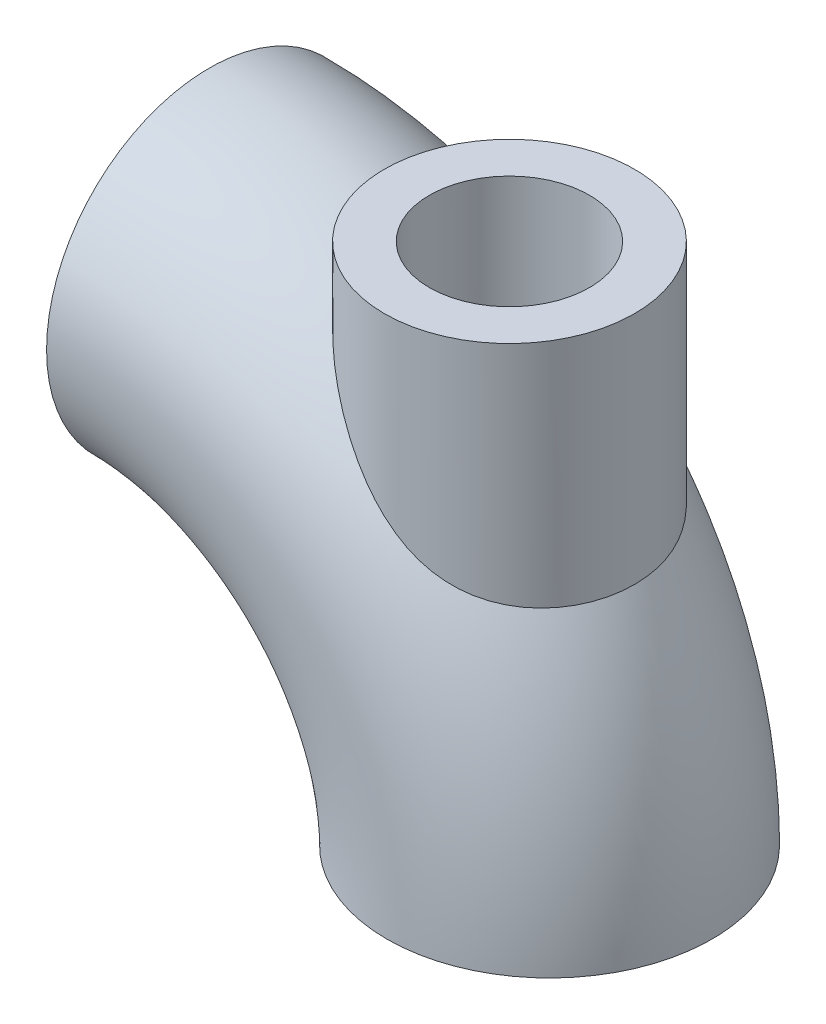
ISO-10303-21;
HEADER;
FILE_DESCRIPTION(('STEP AP214'),'2;1');
FILE_NAME('part.step','',(''),(''),'','','');
FILE_SCHEMA(('AUTOMOTIVE_DESIGN { 1 0 10303 214 1 1 1 1 }'));
ENDSEC;
DATA;
#1=APPLICATION_CONTEXT('core data for automotive mechanical design processes');
#2=APPLICATION_PROTOCOL_DEFINITION('international standard','automotive_design',2000,#1);
#3=PRODUCT_CONTEXT('',#1,'mechanical');
#4=PRODUCT('Part','Part','',(#3));
#5=PRODUCT_RELATED_PRODUCT_CATEGORY('part','',(#4));
#6=PRODUCT_DEFINITION_FORMATION('','',#4);
#7=PRODUCT_DEFINITION_CONTEXT('part definition',#1,'design');
#8=PRODUCT_DEFINITION('design','',#6,#7);
#9=PRODUCT_DEFINITION_SHAPE('','',#8);
#10=(LENGTH_UNIT() NAMED_UNIT(*) SI_UNIT(.MILLI.,.METRE.));
#11=(NAMED_UNIT(*) PLANE_ANGLE_UNIT() SI_UNIT($,.RADIAN.));
#12=(NAMED_UNIT(*) SI_UNIT($,.STERADIAN.) SOLID_ANGLE_UNIT());
#13=UNCERTAINTY_MEASURE_WITH_UNIT(LENGTH_MEASURE(1.E-05),#10,'distance_accuracy_value','');
#14=(GEOMETRIC_REPRESENTATION_CONTEXT(3) GLOBAL_UNCERTAINTY_ASSIGNED_CONTEXT((#13)) GLOBAL_UNIT_ASSIGNED_CONTEXT((#10,
#11,#12)) REPRESENTATION_CONTEXT('',''));
#15=CARTESIAN_POINT('',(0.,0.,0.));
#16=DIRECTION('',(0.,0.,1.));
#17=DIRECTION('',(1.,0.,0.));
#18=AXIS2_PLACEMENT_3D('',#15,#16,#17);
#19=CARTESIAN_POINT('',(-68.,0.,0.));
#20=DIRECTION('',(0.,0.,-1.));
#21=DIRECTION('',(-1.,0.,0.));
#22=AXIS2_PLACEMENT_3D('',#19,#20,#21);
#23=TOROIDAL_SURFACE('',#22,68.,20.);
#24=CARTESIAN_POINT('',(0.251674053511512,46.458689869364,-13.7080222977133));
#25=CARTESIAN_POINT('',(0.579883240702387,46.3070119127707,-13.5104488063518));
#26=CARTESIAN_POINT('',(0.905013391545234,46.1670687579967,-13.2986413226634));
#27=CARTESIAN_POINT('',(1.54464572796947,45.9092450303312,-12.8472967635571));
#28=CARTESIAN_POINT('',(1.85914572640486,45.7913689753574,-12.6077540259615));
#29=CARTESIAN_POINT('',(2.47374917285592,45.5755106213001,-12.1020291615279));
#30=CARTESIAN_POINT('',(2.77383773467794,45.4775485684441,-11.8358203300164));
#31=CARTESIAN_POINT('',(3.35573844524039,45.2992868907994,-11.278717478387));
#32=CARTESIAN_POINT('',(3.63755110468632,45.218986772312,-10.9878241485826));
#33=CARTESIAN_POINT('',(4.17893705828471,45.0738773580956,-10.3844685151367));
#34=CARTESIAN_POINT('',(4.43858871496309,45.0090118937554,-10.0720899223983));
#35=CARTESIAN_POINT('',(4.93437406613024,44.8921118118886,-9.42695517497418));
#36=CARTESIAN_POINT('',(5.17050774611197,44.8400772022766,-9.0941990077188));
#37=CARTESIAN_POINT('',(5.6172299845286,44.7467934258441,-8.41057483469467));
#38=CARTESIAN_POINT('',(5.82782055034193,44.7055434111906,-8.05970825527766));
#39=CARTESIAN_POINT('',(6.22183446259688,44.6320503406775,-7.34213753203489));
#40=CARTESIAN_POINT('',(6.40525706078586,44.5998075328702,-6.97543295236244));
#41=CARTESIAN_POINT('',(6.75119795513024,44.5415616920485,-6.21173769331107));
#42=CARTESIAN_POINT('',(6.91240592914686,44.515904300189,-5.81412658614216));
#43=CARTESIAN_POINT('',(7.20246403487503,44.4714324792229,-5.00689956902898));
#44=CARTESIAN_POINT('',(7.33131335062423,44.4526182226688,-4.59728335665238));
#45=CARTESIAN_POINT('',(7.55572947632467,44.4207792619524,-3.76875426039018));
#46=CARTESIAN_POINT('',(7.65129178795772,44.407755340215,-3.34984012813846));
#47=CARTESIAN_POINT('',(7.8084329024644,44.3867453121045,-2.50556100270997));
#48=CARTESIAN_POINT('',(7.87001121970057,44.3787592777234,-2.08019591743714));
#49=CARTESIAN_POINT('',(7.96022157242804,44.3671599445565,-1.21168523134526));
#50=CARTESIAN_POINT('',(7.9876962824221,44.3637000452235,-0.768416944184042));
#51=CARTESIAN_POINT('',(8.00571104486699,44.361424519783,0.118888199153371));
#52=CARTESIAN_POINT('',(7.99625019030276,44.3626090077262,0.562925073935881));
#53=CARTESIAN_POINT('',(7.94046032816614,44.3696996156558,1.44867162025102));
#54=CARTESIAN_POINT('',(7.89412875588161,44.3756060641,1.89038112774131));
#55=CARTESIAN_POINT('',(7.7649370415422,44.3925198313372,2.76832607859729));
#56=CARTESIAN_POINT('',(7.68207700046105,44.4035271360303,3.20456153709116));
#57=CARTESIAN_POINT('',(7.47993001707069,44.431405126257,4.07069267080586));
#58=CARTESIAN_POINT('',(7.36045789574553,44.4483056803984,4.5005441936349));
#59=CARTESIAN_POINT('',(7.08616001791351,44.4889954130157,5.3484891406377));
#60=CARTESIAN_POINT('',(6.93133393339869,44.5127846554044,5.76658245568042));
#61=CARTESIAN_POINT('',(6.58754180933493,44.5686527300031,6.58801081519642));
#62=CARTESIAN_POINT('',(6.39856970715237,44.6007330347292,6.99134322354989));
#63=CARTESIAN_POINT('',(5.98810213854316,44.6749603221657,7.78014490477518));
#64=CARTESIAN_POINT('',(5.76660706506272,44.7171071832547,8.16561439339479));
#65=CARTESIAN_POINT('',(5.29568831337472,44.8131171790887,8.91162755466653));
#66=CARTESIAN_POINT('',(5.04659635255148,44.8668472211078,9.2723976148262));
#67=CARTESIAN_POINT('',(4.52096109455018,44.9887678618065,9.97078315627513));
#68=CARTESIAN_POINT('',(4.24441773106717,45.0569584954141,10.3083985816343));
#69=CARTESIAN_POINT('',(3.66701628223523,45.2105525486959,10.957614761564));
#70=CARTESIAN_POINT('',(3.36617252740645,45.2959458672943,11.2692306314129));
#71=CARTESIAN_POINT('',(2.74365681901244,45.4869434590673,11.8641964013391));
#72=CARTESIAN_POINT('',(2.4219863255067,45.5925463164641,12.1475482793342));
#73=CARTESIAN_POINT('',(1.7796252522069,45.8206626204229,12.6696915572007));
#74=CARTESIAN_POINT('',(1.45978370352528,45.9419853798179,12.9100475814182));
#75=CARTESIAN_POINT('',(0.809567487822008,46.2074757689163,13.3621964615403));
#76=CARTESIAN_POINT('',(0.479193523500135,46.3516418770986,13.5739912180798));
#77=CARTESIAN_POINT('',(-0.187205663973733,46.6641304512066,13.9681788423492));
#78=CARTESIAN_POINT('',(-0.523226220535772,46.8324337597951,14.1505947861271));
#79=CARTESIAN_POINT('',(-1.19649364470052,47.1937378381569,14.4863324106089));
#80=CARTESIAN_POINT('',(-1.53374047533667,47.3867378693364,14.6396549610555));
#81=CARTESIAN_POINT('',(-2.18107020915887,47.7820470381146,14.9081840709015));
#82=CARTESIAN_POINT('',(-2.49136663894353,47.9826958611934,15.0253356200988));
#83=CARTESIAN_POINT('',(-3.10649403559755,48.4033663573817,15.2367776152165));
#84=CARTESIAN_POINT('',(-3.41132529782902,48.6233869797306,15.3310693000561));
#85=CARTESIAN_POINT('',(-4.01352589590269,49.0809638778267,15.498572653174));
#86=CARTESIAN_POINT('',(-4.31089411461001,49.3185227581253,15.5717811825159));
#87=CARTESIAN_POINT('',(-4.89692235272744,49.8089995218885,15.6990717459209));
#88=CARTESIAN_POINT('',(-5.1855813646602,50.0619191721617,15.7531515748845));
#89=CARTESIAN_POINT('',(-5.72217049849194,50.552099589437,15.8390946805061));
#90=CARTESIAN_POINT('',(-5.97107140597724,50.7879934651296,15.8727548444661));
#91=CARTESIAN_POINT('',(-6.46160307914626,51.2686615948951,15.9277827087778));
#92=CARTESIAN_POINT('',(-6.70323258279266,51.5134373744497,15.9491482867889));
#93=CARTESIAN_POINT('',(-7.17958450530103,52.0106057334975,15.9807364068048));
#94=CARTESIAN_POINT('',(-7.41430210501676,52.263003389899,15.990951345301));
#95=CARTESIAN_POINT('',(-7.87706295526514,52.774002410859,16.0012013881868));
#96=CARTESIAN_POINT('',(-8.10510648724459,53.0326035129777,16.0012369224643));
#97=CARTESIAN_POINT('',(-8.55645099120217,53.5565768880202,15.9919239671556));
#98=CARTESIAN_POINT('',(-8.77971294461455,53.8219815966229,15.9825162466993));
#99=CARTESIAN_POINT('',(-9.22054340959509,54.3570125144336,15.9549065440942));
#100=CARTESIAN_POINT('',(-9.43811191853874,54.6266387255876,15.9367045578915));
#101=CARTESIAN_POINT('',(-9.86804129535707,55.1691991464139,15.8920458251801));
#102=CARTESIAN_POINT('',(-10.0804036687679,55.4421323648039,15.8655914962354));
#103=CARTESIAN_POINT('',(-10.5005117930674,55.9906712766157,15.8048239340841));
#104=CARTESIAN_POINT('',(-10.7082573027567,56.2662771085876,15.7705102913365));
#105=CARTESIAN_POINT('',(-11.2883660625144,57.0464676405934,15.66307254321));
#106=CARTESIAN_POINT('',(-11.655962983592,57.5534155848043,15.581202780049));
#107=CARTESIAN_POINT('',(-12.3799956814476,58.5708517720675,15.393357238491));
#108=CARTESIAN_POINT('',(-12.736429834046,59.0813405172278,15.2873779705364));
#109=CARTESIAN_POINT('',(-13.4404076087609,60.1037253038768,15.0512439462692));
#110=CARTESIAN_POINT('',(-13.7879409236014,60.6156222784805,14.9210624866694));
#111=CARTESIAN_POINT('',(-14.4750358096254,61.6378378756069,14.6359908448986));
#112=CARTESIAN_POINT('',(-14.8145979476431,62.1481566081047,14.4811024257944));
#113=CARTESIAN_POINT('',(-15.4845850878166,63.161948671785,14.1463908208147));
#114=CARTESIAN_POINT('',(-15.8150524496638,63.6654446688288,13.9667215594999));
#115=CARTESIAN_POINT('',(-16.4692375050918,64.6664094030436,13.580000580758));
#116=CARTESIAN_POINT('',(-16.7929544193633,65.1638774415664,13.372945721823));
#117=CARTESIAN_POINT('',(-17.4327891924138,66.1493626010487,12.9295687996369));
#118=CARTESIAN_POINT('',(-17.7489183035085,66.6373934771913,12.6932937409786));
#119=CARTESIAN_POINT('',(-18.3731084905584,67.6016648601189,12.1885075943215));
#120=CARTESIAN_POINT('',(-18.6811724183213,68.0779095310966,11.9200080934986));
#121=CARTESIAN_POINT('',(-19.1866543224654,68.8589533934259,11.4427296956968));
#122=CARTESIAN_POINT('',(-19.3867691641188,69.1680531594254,11.2438215196857));
#123=CARTESIAN_POINT('',(-19.781953770648,69.7780022744386,10.8290187501038));
#124=CARTESIAN_POINT('',(-19.9770237271708,70.0788519368865,10.6131248030578));
#125=CARTESIAN_POINT('',(-20.3613458226139,70.6709340290156,10.1629135040098));
#126=CARTESIAN_POINT('',(-20.5505922238301,70.962156993634,9.92857874355975));
#127=CARTESIAN_POINT('',(-20.9218286556424,71.5326699178218,9.44035965124985));
#128=CARTESIAN_POINT('',(-21.103818669889,71.8119598505046,9.18647527534621));
#129=CARTESIAN_POINT('',(-21.4607583435968,72.3589044057939,8.65514064600163));
#130=CARTESIAN_POINT('',(-21.635617534417,72.6264117377751,8.37747690913698));
#131=CARTESIAN_POINT('',(-21.9742575927428,73.1436342600118,7.79950660033313));
#132=CARTESIAN_POINT('',(-22.1380368361415,73.3933468421844,7.49919672248942));
#133=CARTESIAN_POINT('',(-22.4515929484794,73.8706373813989,6.87554046391114));
#134=CARTESIAN_POINT('',(-22.6013955163031,74.0982559949804,6.55223836888785));
#135=CARTESIAN_POINT('',(-22.8841382120246,74.5271980824955,5.88171920428421));
#136=CARTESIAN_POINT('',(-23.0170877024387,74.728536158117,5.53451557980511));
#137=CARTESIAN_POINT('',(-23.2207963390648,75.0365999243379,4.93863667495585));
#138=CARTESIAN_POINT('',(-23.2973469387752,75.1522426758494,4.69652186590179));
#139=CARTESIAN_POINT('',(-23.4403333465376,75.368065619921,4.20263599887786));
#140=CARTESIAN_POINT('',(-23.506772159088,75.4682504056031,3.9508678371371));
#141=CARTESIAN_POINT('',(-23.6283354587955,75.651427075337,3.43865675380512));
#142=CARTESIAN_POINT('',(-23.6834672189544,75.7344300115411,3.17821953450182));
#143=CARTESIAN_POINT('',(-23.781344079373,75.8817037739929,2.64978612443474));
#144=CARTESIAN_POINT('',(-23.8240890001784,75.9459743288553,2.38178982422052));
#145=CARTESIAN_POINT('',(-23.8964841755331,76.0547835350074,1.83783595012664));
#146=CARTESIAN_POINT('',(-23.9260296041006,76.0991642361693,1.56183255932241));
#147=CARTESIAN_POINT('',(-23.9707729340308,76.1663601075805,1.00604357553352));
#148=CARTESIAN_POINT('',(-23.9859709567338,76.1891754602145,0.726258014556141));
#149=CARTESIAN_POINT('',(-24.0016037004,76.2126432694942,0.165407594714142));
#150=CARTESIAN_POINT('',(-24.0020418574311,76.2133008844179,-0.115656951167201));
#151=CARTESIAN_POINT('',(-23.9881497334985,76.192446349183,-0.676581634648807));
#152=CARTESIAN_POINT('',(-23.9738202830348,76.1709354457368,-0.956441839090014));
#153=CARTESIAN_POINT('',(-23.9329632134646,76.1095780507171,-1.48444916015975));
#154=CARTESIAN_POINT('',(-23.9078114673255,76.0717994046821,-1.73294824843188));
#155=CARTESIAN_POINT('',(-23.846424429154,75.9795492928928,-2.22539769798944));
#156=CARTESIAN_POINT('',(-23.810190262949,75.925079522735,-2.46934851864923));
#157=CARTESIAN_POINT('',(-23.7273269811673,75.8004362407695,-2.95144534290876));
#158=CARTESIAN_POINT('',(-23.680695322599,75.730258887226,-3.18958991059636));
#159=CARTESIAN_POINT('',(-23.5778517520154,75.5753726841425,-3.65900372617647));
#160=CARTESIAN_POINT('',(-23.5216375794258,75.4906604056929,-3.8902713365983));
#161=CARTESIAN_POINT('',(-23.3766941015435,75.2720538174676,-4.43448753955856));
#162=CARTESIAN_POINT('',(-23.2838644350664,75.131908527181,-4.74385322269917));
#163=CARTESIAN_POINT('',(-23.0836523714274,74.8292438055284,-5.34643533094642));
#164=CARTESIAN_POINT('',(-22.9762649073869,74.6667165837606,-5.63964608309159));
#165=CARTESIAN_POINT('',(-22.6351989796666,74.149772808701,-6.49525259502075));
#166=CARTESIAN_POINT('',(-22.3828172290202,73.766295517252,-7.03290513764104));
#167=CARTESIAN_POINT('',(-21.9026778300038,73.0344948464678,-7.93193174517853));
#168=CARTESIAN_POINT('',(-21.6816692573746,72.6969223281066,-8.30609868720648));
#169=CARTESIAN_POINT('',(-21.2232267281498,71.9951544056235,-9.01806281813176));
#170=CARTESIAN_POINT('',(-20.9857831703097,71.6309434322726,-9.35583844777389));
#171=CARTESIAN_POINT('',(-20.4980221713174,70.8813787818105,-9.99811892416891));
#172=CARTESIAN_POINT('',(-20.247684635888,70.4959920373785,-10.3025693782065));
#173=CARTESIAN_POINT('',(-19.7372177704113,69.709069937324,-10.8805478752379));
#174=CARTESIAN_POINT('',(-19.4770895868502,69.3075364721101,-11.1540795239032));
#175=CARTESIAN_POINT('',(-18.9757364225663,68.5331177723306,-11.6466227045903));
#176=CARTESIAN_POINT('',(-18.7352694031519,68.1614563429765,-11.8683501316332));
#177=CARTESIAN_POINT('',(-18.2488918139375,67.4097845067116,-12.2908091670372));
#178=CARTESIAN_POINT('',(-18.0029803530284,67.0297727331507,-12.4915373071328));
#179=CARTESIAN_POINT('',(-17.5062267514865,66.2628550427592,-12.8736127653081));
#180=CARTESIAN_POINT('',(-17.2553811181414,65.8759442619308,-13.0549457235411));
#181=CARTESIAN_POINT('',(-16.7493261605706,65.0969462119409,-13.3993642430519));
#182=CARTESIAN_POINT('',(-16.4941170550416,64.7048592024343,-13.5624507157689));
#183=CARTESIAN_POINT('',(-15.978691486547,63.9155643028802,-13.8719543180626));
#184=CARTESIAN_POINT('',(-15.7184622716741,63.5183445577079,-14.0183198361062));
#185=CARTESIAN_POINT('',(-15.1936646558539,62.7211026681248,-14.2947243396335));
#186=CARTESIAN_POINT('',(-14.9290961776495,62.3210804738915,-14.4247630340734));
#187=CARTESIAN_POINT('',(-14.3954590430704,61.5195337442,-14.6691577774436));
#188=CARTESIAN_POINT('',(-14.1263924443318,61.1180099575444,-14.7835207881624));
#189=CARTESIAN_POINT('',(-13.5831579829091,60.314402531826,-14.9971177004988));
#190=CARTESIAN_POINT('',(-13.3089902402822,59.9123189061448,-15.0963519576731));
#191=CARTESIAN_POINT('',(-12.7986971179572,59.1723475628629,-15.2654134393996));
#192=CARTESIAN_POINT('',(-12.5634175243848,58.8343702354233,-15.3374091975642));
#193=CARTESIAN_POINT('',(-12.0882046354122,58.1596107969389,-15.4708597249989));
#194=CARTESIAN_POINT('',(-11.8482714265375,57.8228286638092,-15.5323146900468));
#195=CARTESIAN_POINT('',(-11.3630066287621,57.1511724531035,-15.6445592523682));
#196=CARTESIAN_POINT('',(-11.1176729742866,56.8162991695196,-15.6953446875839));
#197=CARTESIAN_POINT('',(-10.6209407030664,56.1495651275626,-15.7858927890917));
#198=CARTESIAN_POINT('',(-10.3695421322851,55.8177043463853,-15.8256555388913));
#199=CARTESIAN_POINT('',(-9.86075529556535,55.1593342678534,-15.8934961603523));
#200=CARTESIAN_POINT('',(-9.60339238963776,54.8328098034169,-15.9216163679844));
#201=CARTESIAN_POINT('',(-9.08085331806901,54.1851768045657,-15.9656040342972));
#202=CARTESIAN_POINT('',(-8.81567672830606,53.8640685656333,-15.9814708265937));
#203=CARTESIAN_POINT('',(-8.27677236133268,53.2291017902374,-15.9998761590972));
#204=CARTESIAN_POINT('',(-8.00305128956462,52.9152378891865,-16.0024248988987));
#205=CARTESIAN_POINT('',(-7.44601615460377,52.2964342037791,-15.9928321452727));
#206=CARTESIAN_POINT('',(-7.16270392039125,51.9914927384122,-15.9806934374903));
#207=CARTESIAN_POINT('',(-6.55923801614523,51.3651927841751,-15.9381279512961));
#208=CARTESIAN_POINT('',(-6.23808788386226,51.0448919127747,-15.9061267018528));
#209=CARTESIAN_POINT('',(-5.58294791169677,50.4207222315935,-15.8198288894741));
#210=CARTESIAN_POINT('',(-5.24895815646316,50.116853313512,-15.7655324735034));
#211=CARTESIAN_POINT('',(-4.56934018212486,49.529808948925,-15.6317057060511));
#212=CARTESIAN_POINT('',(-4.22374035553886,49.2465877240703,-15.5522334036544));
#213=CARTESIAN_POINT('',(-3.52190313482271,48.7037101765695,-15.3648427633185));
#214=CARTESIAN_POINT('',(-3.16566926713037,48.4440461548158,-15.2569337645821));
#215=CARTESIAN_POINT('',(-2.5538909243651,48.0253100157292,-15.0469537295546));
#216=CARTESIAN_POINT('',(-2.30022936878432,47.859444104417,-14.9528580584908));
#217=CARTESIAN_POINT('',(-1.79078965423797,47.541459148082,-14.7485926148329));
#218=CARTESIAN_POINT('',(-1.53501181869408,47.3893380433635,-14.6384252571145));
#219=CARTESIAN_POINT('',(-1.02295965167156,47.0991776393209,-14.4014071978735));
#220=CARTESIAN_POINT('',(-0.766685118739929,46.9611465251076,-14.2745468959824));
#221=CARTESIAN_POINT('',(-0.255773358587455,46.6993188512022,-14.0039475821005));
#222=CARTESIAN_POINT('',(-0.00113622770097689,46.5755231219256,-13.8602075864273));
#223=CARTESIAN_POINT('',(0.251674053511512,46.458689869364,-13.7080222977133));
#224=B_SPLINE_CURVE_WITH_KNOTS('',3,(#24,#25,#26,#27,#28,#29,#30,#31,#32,#33,#34,#35,#36,#37,
#38,#39,#40,#41,#42,#43,#44,#45,#46,#47,#48,#49,#50,#51,#52,#53,#54,#55,#56,#57,#58,#59,#60,#61,
#62,#63,#64,#65,#66,#67,#68,#69,#70,#71,#72,#73,#74,#75,#76,#77,#78,#79,#80,#81,#82,#83,#84,#85,
#86,#87,#88,#89,#90,#91,#92,#93,#94,#95,#96,#97,#98,#99,#100,#101,#102,#103,#104,#105,#106,#107,
#108,#109,#110,#111,#112,#113,#114,#115,#116,#117,#118,#119,#120,#121,#122,#123,#124,#125,#126,
#127,#128,#129,#130,#131,#132,#133,#134,#135,#136,#137,#138,#139,#140,#141,#142,#143,#144,#145,
#146,#147,#148,#149,#150,#151,#152,#153,#154,#155,#156,#157,#158,#159,#160,#161,#162,#163,#164,
#165,#166,#167,#168,#169,#170,#171,#172,#173,#174,#175,#176,#177,#178,#179,#180,#181,#182,#183,
#184,#185,#186,#187,#188,#189,#190,#191,#192,#193,#194,#195,#196,#197,#198,#199,#200,#201,#202,
#203,#204,#205,#206,#207,#208,#209,#210,#211,#212,#213,#214,#215,#216,#217,#218,#219,#220,#221,
#222,#223),.UNSPECIFIED.,.T.,.F.,(4,2,2,2,2,2,2,2,2,2,2,2,2,2,2,2,2,2,2,2,2,2,2,2,2,2,2,2,2,2,2,
2,2,2,2,2,2,2,2,2,2,2,2,2,2,2,2,2,2,2,2,2,2,2,2,2,2,2,2,2,2,2,2,2,2,2,2,2,2,2,2,2,2,2,2,2,2,2,2,
2,2,2,2,2,2,2,2,2,2,2,2,2,2,2,2,2,2,2,2,4),(0.,1.23574601934018,2.47174476367838,
3.70899391049281,4.94620846845607,6.1788493293815,7.41149095065616,8.64403563842437,
9.8766142662866,11.164599543023,12.4526172945915,13.7408090380242,15.0290191894743,
16.3598460532561,17.690705597941,19.0216577247679,20.3526061725375,21.6904007038695,
23.0282076475326,24.3662523529533,25.7042808932966,27.0276849103967,28.3510921240679,
29.6737245124326,30.9962642777804,32.2488135814002,33.5012794918342,34.7527567842166,
36.0041966579749,37.165885974542,38.3275123178083,39.4893115188936,40.6512446051026,
41.6845249608,42.7179836320173,43.7521465689033,44.7862658319048,45.8269121797352,
46.8675590072644,47.9079012580638,48.9482977323962,50.842201992741,52.7363805473022,
54.6326615666481,56.5288073295397,58.413665412758,60.2987399031729,62.1808205089537,
64.0622263776427,65.3173762717553,66.5724784145191,67.8287799461573,69.0850843082306,
70.3541705722171,71.6234424585677,72.8903325432615,74.1565157095078,74.9929028955152,
75.8290410799835,76.6646397392214,77.5002505035865,78.3423843135569,79.1845110012791,
80.026441642197,80.868324937234,81.6253072706083,82.3822127301121,83.139303515038,
83.8965731501552,84.9511808371501,86.0061565299892,88.1184889171681,89.7673053148276,
91.417093208641,93.0695349180226,94.7217837246633,96.2064887186056,97.6914385422132,
99.1774802948216,100.663447784258,102.15388460357,103.644347987796,105.134147276862,
106.623911547185,107.877920923001,109.131907005138,110.386381347924,111.640846186612,
112.890708457521,114.140638695587,115.389611537491,116.638347534303,118.00155592798,
119.364755335853,120.724834159917,122.084466861271,123.035864990673,123.987120313259,
124.938925128221,125.890785438197),.UNSPECIFIED.);
#225=CARTESIAN_POINT('',(0.251674053511512,46.458689869364,-13.7080222977133));
#226=VERTEX_POINT('',#225);
#227=EDGE_CURVE('E63',#226,#226,#224,.T.);
#228=ORIENTED_EDGE('',*,*,#227,.F.);
#229=EDGE_LOOP('',(#228));
#230=FACE_BOUND('',#229,.T.);
#231=CARTESIAN_POINT('',(-68.,68.,0.));
#232=DIRECTION('',(-1.,0.,0.));
#233=DIRECTION('',(0.,0.,1.));
#234=AXIS2_PLACEMENT_3D('',#231,#232,#233);
#235=CIRCLE('',#234,20.);
#236=CARTESIAN_POINT('',(-68.,68.,20.));
#237=VERTEX_POINT('',#236);
#238=EDGE_CURVE('E40',#237,#237,#235,.T.);
#239=ORIENTED_EDGE('',*,*,#238,.T.);
#240=EDGE_LOOP('',(#239));
#241=FACE_BOUND('',#240,.T.);
#242=CARTESIAN_POINT('',(0.,0.,0.));
#243=DIRECTION('',(0.,1.,0.));
#244=DIRECTION('',(0.,0.,1.));
#245=AXIS2_PLACEMENT_3D('',#242,#243,#244);
#246=CIRCLE('',#245,20.);
#247=CARTESIAN_POINT('',(0.,0.,20.));
#248=VERTEX_POINT('',#247);
#249=EDGE_CURVE('E48',#248,#248,#246,.T.);
#250=ORIENTED_EDGE('',*,*,#249,.F.);
#251=EDGE_LOOP('',(#250));
#252=FACE_BOUND('',#251,.T.);
#253=ADVANCED_FACE('F33',(#230,#241,#252),#23,.F.);
#254=CARTESIAN_POINT('',(-68.,0.,0.));
#255=DIRECTION('',(0.,0.,-1.));
#256=DIRECTION('',(-1.,0.,0.));
#257=AXIS2_PLACEMENT_3D('',#254,#255,#256);
#258=TOROIDAL_SURFACE('',#257,68.,32.5);
#259=CARTESIAN_POINT('',(-7.01580041526171,64.533465892096,-24.9806195114813));
#260=CARTESIAN_POINT('',(-7.50000163833847,64.9594961827475,-24.9996962259398));
#261=CARTESIAN_POINT('',(-7.9777575639453,65.3934306288262,-25.0044381305077));
#262=CARTESIAN_POINT('',(-8.92094143093466,66.274107440392,-24.9874846183522));
#263=CARTESIAN_POINT('',(-9.38636699447698,66.7208522421879,-24.9657841397415));
#264=CARTESIAN_POINT('',(-10.3059268531832,67.6246442397286,-24.8976991548612));
#265=CARTESIAN_POINT('',(-10.7600519102201,68.0816993175322,-24.8512951052859));
#266=CARTESIAN_POINT('',(-11.6575211998291,69.0032793876033,-24.7351421067268));
#267=CARTESIAN_POINT('',(-12.1008660000686,69.4678039843911,-24.6653943898429));
#268=CARTESIAN_POINT('',(-12.979857527246,70.4044359962531,-24.5030961792109));
#269=CARTESIAN_POINT('',(-13.415456415573,70.8765692802675,-24.4104365955119));
#270=CARTESIAN_POINT('',(-14.2776036251464,71.8242375713167,-24.2030630407496));
#271=CARTESIAN_POINT('',(-14.7041518431774,72.2997726170632,-24.0883488183215));
#272=CARTESIAN_POINT('',(-15.5487637566158,73.2522725204222,-23.8371600150919));
#273=CARTESIAN_POINT('',(-15.9668307294463,73.7292367407056,-23.7006940276555));
#274=CARTESIAN_POINT('',(-16.7952221803384,74.6831386646221,-23.4059252763254));
#275=CARTESIAN_POINT('',(-17.2055466679681,75.1600763682872,-23.2476225394194));
#276=CARTESIAN_POINT('',(-18.0314880059042,76.1271837207069,-22.903614550836));
#277=CARTESIAN_POINT('',(-18.4468724769462,76.6173035013402,-22.7172101046105));
#278=CARTESIAN_POINT('',(-19.2700120743174,77.5942002950944,-22.3202956587776));
#279=CARTESIAN_POINT('',(-19.677767121527,78.0809772735162,-22.1097854093461));
#280=CARTESIAN_POINT('',(-20.4857714074921,79.0497293388976,-21.6637614631673));
#281=CARTESIAN_POINT('',(-20.8860170901771,79.5317021025816,-21.4282362554975));
#282=CARTESIAN_POINT('',(-21.6784727809888,80.4888589685416,-20.9312712709705));
#283=CARTESIAN_POINT('',(-22.0706829403141,80.9640431985016,-20.6698319822613));
#284=CARTESIAN_POINT('',(-22.8443177892631,81.9031661196558,-20.1213771157135));
#285=CARTESIAN_POINT('',(-23.2257899493853,82.367152300729,-19.8345101809651));
#286=CARTESIAN_POINT('',(-23.9792723829899,83.2845697088722,-19.2326638252738));
#287=CARTESIAN_POINT('',(-24.3512820308359,83.7380002378633,-18.917682551661));
#288=CARTESIAN_POINT('',(-25.0841674578201,84.6315646078028,-18.2585291665998));
#289=CARTESIAN_POINT('',(-25.4450536807015,85.0717109126487,-17.9143856492122));
#290=CARTESIAN_POINT('',(-26.1542944941156,85.9364744530913,-17.1952484922193));
#291=CARTESIAN_POINT('',(-26.5026520595982,86.3610953756186,-16.8202622467154));
#292=CARTESIAN_POINT('',(-27.1744468622082,87.1793533269875,-16.049731122135));
#293=CARTESIAN_POINT('',(-27.498319157561,87.573539046356,-15.655151134068));
#294=CARTESIAN_POINT('',(-28.1298664591132,88.3413963418216,-14.8343044979514));
#295=CARTESIAN_POINT('',(-28.4375429642411,88.7150698164746,-14.4080407910845));
#296=CARTESIAN_POINT('',(-29.0336925600169,89.4381822845462,-13.5228851533359));
#297=CARTESIAN_POINT('',(-29.3221703180672,89.7876271690411,-13.064001209269));
#298=CARTESIAN_POINT('',(-29.8764643269416,90.4581397882226,-12.1129319803741));
#299=CARTESIAN_POINT('',(-30.1422834814176,90.7792111591089,-11.6207509770364));
#300=CARTESIAN_POINT('',(-30.6089419263279,91.3420772830968,-10.6802629426229));
#301=CARTESIAN_POINT('',(-30.8135259459551,91.5885147850117,-10.2365960009416));
#302=CARTESIAN_POINT('',(-31.2006324441611,92.054276120715,-9.32605278955096));
#303=CARTESIAN_POINT('',(-31.3831601456942,92.2736063738037,-8.85918205162145));
#304=CARTESIAN_POINT('',(-31.7230986079322,92.6816524260634,-7.90388409008696));
#305=CARTESIAN_POINT('',(-31.8805310138393,92.8703946104351,-7.41547591232452));
#306=CARTESIAN_POINT('',(-32.1674591545328,93.2140721745286,-6.41892471930243));
#307=CARTESIAN_POINT('',(-32.2969594375992,93.369013058275,-5.91078493293134));
#308=CARTESIAN_POINT('',(-32.5079513130383,93.6212723428506,-4.95600151791427));
#309=CARTESIAN_POINT('',(-32.5937405083141,93.7237601808161,-4.5116686971211));
#310=CARTESIAN_POINT('',(-32.7416552018072,93.9003843596848,-3.61352238627484));
#311=CARTESIAN_POINT('',(-32.8037830262624,93.9745234876587,-3.15970983283956));
#312=CARTESIAN_POINT('',(-32.9031748871732,94.0930975725319,-2.24568886016046));
#313=CARTESIAN_POINT('',(-32.9404486109672,94.1375441026749,-1.78548300430491));
#314=CARTESIAN_POINT('',(-32.9894229864119,94.1959377015481,-0.861765051484157));
#315=CARTESIAN_POINT('',(-33.0011232249575,94.209884277593,-0.398252901231596));
#316=CARTESIAN_POINT('',(-32.9987057518116,94.2070023624511,0.529029328143003));
#317=CARTESIAN_POINT('',(-32.9845645531647,94.1901458747493,0.992799258532557));
#318=CARTESIAN_POINT('',(-32.9307110142207,94.1259323453447,1.91671359280524));
#319=CARTESIAN_POINT('',(-32.8909986744637,94.0785753042859,2.37685799676493));
#320=CARTESIAN_POINT('',(-32.7867861048217,93.9542410839764,3.29038996426278));
#321=CARTESIAN_POINT('',(-32.722279034878,93.8772557312317,3.74377562740066));
#322=CARTESIAN_POINT('',(-32.569701283475,93.6950439785366,4.64077422915271));
#323=CARTESIAN_POINT('',(-32.4816300755771,93.5898169476482,5.08438694919316));
#324=CARTESIAN_POINT('',(-32.2834046076513,93.3527884514046,5.95967898955888));
#325=CARTESIAN_POINT('',(-32.1732365261888,93.2209703532318,6.39135064757025));
#326=CARTESIAN_POINT('',(-31.9325997206027,92.9327787429362,7.24054280109112));
#327=CARTESIAN_POINT('',(-31.8021315133861,92.7764058560572,7.65806365659637));
#328=CARTESIAN_POINT('',(-31.5226843903543,92.4411345660182,8.47766687208589));
#329=CARTESIAN_POINT('',(-31.37370093558,92.2622306392951,8.87974541468328));
#330=CARTESIAN_POINT('',(-31.0590553674549,91.8839892729229,9.6674684499955));
#331=CARTESIAN_POINT('',(-30.8933894207659,91.684647136747,10.0531091364783));
#332=CARTESIAN_POINT('',(-30.4505137728552,91.1511539864905,11.0178181247899));
#333=CARTESIAN_POINT('',(-30.1626360078097,90.8038367539924,11.5847736848964));
#334=CARTESIAN_POINT('',(-29.5567030092604,90.0715257929761,12.6767059947333));
#335=CARTESIAN_POINT('',(-29.2386340536497,89.6865149299176,13.2016634543449));
#336=CARTESIAN_POINT('',(-28.5770042764905,88.8843830415207,14.210968526055));
#337=CARTESIAN_POINT('',(-28.2333999603159,88.4672071817457,14.6952437105392));
#338=CARTESIAN_POINT('',(-27.5255108630007,87.6066568453949,15.6235460104679));
#339=CARTESIAN_POINT('',(-27.1612264262842,87.1632828051403,16.0675737959065));
#340=CARTESIAN_POINT('',(-26.502511092029,86.360894288684,16.8179899816115));
#341=CARTESIAN_POINT('',(-26.2116176994662,86.0063393284941,17.132317029809));
#342=CARTESIAN_POINT('',(-25.6209282350093,85.2861704232085,17.7392853402732));
#343=CARTESIAN_POINT('',(-25.3211311621568,84.920555234627,18.0319241513068));
#344=CARTESIAN_POINT('',(-24.7135787691492,84.1797060133512,18.5964599234887));
#345=CARTESIAN_POINT('',(-24.4058198620115,83.8044676458877,18.8683473098346));
#346=CARTESIAN_POINT('',(-23.7833153412939,83.0459305082664,19.3920705507114));
#347=CARTESIAN_POINT('',(-23.4685699314433,82.6626319731635,19.6439069889567));
#348=CARTESIAN_POINT('',(-22.8316983602448,81.8879589184698,20.1291208459275));
#349=CARTESIAN_POINT('',(-22.5095514994561,81.496562162318,20.3624354752706));
#350=CARTESIAN_POINT('',(-21.8593265943152,80.7080258049835,20.810453125144));
#351=CARTESIAN_POINT('',(-21.5312479645762,80.310885637785,21.0251542965231));
#352=CARTESIAN_POINT('',(-20.8695887711935,79.5120513598816,21.4365439699578));
#353=CARTESIAN_POINT('',(-20.5360092997396,79.1103581580161,21.6332359980932));
#354=CARTESIAN_POINT('',(-19.8635024221135,78.3033860911739,22.0092184211676));
#355=CARTESIAN_POINT('',(-19.5245753329367,77.8981074393561,22.1885098431058));
#356=CARTESIAN_POINT('',(-18.739047443821,76.9630613523714,22.581393399203));
#357=CARTESIAN_POINT('',(-18.2906139254867,76.4323801339826,22.7891655996765));
#358=CARTESIAN_POINT('',(-17.3846020751493,75.368666917602,23.1769727559629));
#359=CARTESIAN_POINT('',(-16.9270232236001,74.8356347874032,23.3570061308448));
#360=CARTESIAN_POINT('',(-16.0019248823878,73.7690423079384,23.6898929821935));
#361=CARTESIAN_POINT('',(-15.5343989105959,73.2354818445931,23.8427280870161));
#362=CARTESIAN_POINT('',(-14.588923958692,72.1705037887352,24.1211307144888));
#363=CARTESIAN_POINT('',(-14.1109752785591,71.6390861350699,24.2466990207759));
#364=CARTESIAN_POINT('',(-13.1451271419139,70.5825735942473,24.4698295984514));
#365=CARTESIAN_POINT('',(-12.6572642093186,70.0574639639069,24.5674797581585));
#366=CARTESIAN_POINT('',(-11.6688507216283,69.0146101195426,24.7344046902675));
#367=CARTESIAN_POINT('',(-11.1682992613032,68.4968664351604,24.8036774320717));
#368=CARTESIAN_POINT('',(-10.1537475215506,67.4725030890031,24.9122739145014));
#369=CARTESIAN_POINT('',(-9.63976160909896,66.9658725301117,24.951628395464));
#370=CARTESIAN_POINT('',(-8.59675344752273,65.9669647764586,24.9983265636505));
#371=CARTESIAN_POINT('',(-8.06773480344013,65.4746841968062,25.0056778615187));
#372=CARTESIAN_POINT('',(-6.98455813498783,64.5003101970195,24.9853406729569));
#373=CARTESIAN_POINT('',(-6.43012579922839,64.0185315828382,24.9570552312236));
#374=CARTESIAN_POINT('',(-5.30462541310273,63.0789241697033,24.8606891258705));
#375=CARTESIAN_POINT('',(-4.73355932199566,62.6210925676939,24.7926131312395));
#376=CARTESIAN_POINT('',(-3.57692570262927,61.7352903596646,24.6125623165473));
#377=CARTESIAN_POINT('',(-2.9913867805021,61.3072663762711,24.500668474441));
#378=CARTESIAN_POINT('',(-1.80767277489537,60.4851571541299,24.2285725745701));
#379=CARTESIAN_POINT('',(-1.20949779479103,60.0910716378664,24.0683709118681));
#380=CARTESIAN_POINT('',(0.00163472736119897,59.3367075872189,23.6934625374801));
#381=CARTESIAN_POINT('',(0.614683320489159,58.9768774276642,23.4781413603005));
#382=CARTESIAN_POINT('',(1.8415967401694,58.2992438851783,22.9908345948949));
#383=CARTESIAN_POINT('',(2.45546156250535,57.9814402859992,22.7188492982531));
#384=CARTESIAN_POINT('',(3.67556388323683,57.3887234595091,22.1166022184876));
#385=CARTESIAN_POINT('',(4.28179917619008,57.1138223834512,21.7863239813311));
#386=CARTESIAN_POINT('',(5.47718631422348,56.6058981065336,21.0677851160522));
#387=CARTESIAN_POINT('',(6.0663394247731,56.372871796857,20.6795287961919));
#388=CARTESIAN_POINT('',(7.14727352698041,55.9722250270015,19.8984511628258));
#389=CARTESIAN_POINT('',(7.64209105488936,55.8000806306044,19.5121216854954));
#390=CARTESIAN_POINT('',(8.60608926729737,55.4830875664319,18.6985426102758));
#391=CARTESIAN_POINT('',(9.07527238970422,55.3382362997797,18.2712969143158));
#392=CARTESIAN_POINT('',(9.98314541119746,55.0728388227091,17.3784904808564));
#393=CARTESIAN_POINT('',(10.421831281461,54.9522958195378,16.9129246987779));
#394=CARTESIAN_POINT('',(11.2643981052631,54.7325129011238,15.946596213941));
#395=CARTESIAN_POINT('',(11.6682778277188,54.6332737392064,15.4458322673707));
#396=CARTESIAN_POINT('',(12.4394844614279,54.4527899516545,14.4099446349966));
#397=CARTESIAN_POINT('',(12.8066216869929,54.3716362938401,13.8746639705817));
#398=CARTESIAN_POINT('',(13.4989781059171,54.2253093191568,12.7755935546627));
#399=CARTESIAN_POINT('',(13.8241976747312,54.1601358591491,12.2118040585741));
#400=CARTESIAN_POINT('',(14.4301726955055,54.0434649256063,11.0594379182111));
#401=CARTESIAN_POINT('',(14.7109263422908,53.9919680072377,10.470860268844));
#402=CARTESIAN_POINT('',(15.2258602928325,53.9007165141911,9.27278766261568));
#403=CARTESIAN_POINT('',(15.460039195333,53.8609622927885,8.66329207706056));
#404=CARTESIAN_POINT('',(15.8895941466116,53.7900642566707,7.39949355954823));
#405=CARTESIAN_POINT('',(16.0827496389283,53.7593884564738,6.74440856177511));
#406=CARTESIAN_POINT('',(16.4148869989717,53.7077669579741,5.42026326035984));
#407=CARTESIAN_POINT('',(16.5538673297423,53.6868215357201,4.7512025607926));
#408=CARTESIAN_POINT('',(16.7766347892473,53.6536922032067,3.40364634626702));
#409=CARTESIAN_POINT('',(16.8604143677691,53.6415094914668,2.72514955361905));
#410=CARTESIAN_POINT('',(16.9721363628764,53.6253366701241,1.36347951707612));
#411=CARTESIAN_POINT('',(17.0000785802866,53.6213465897451,0.680306256508659));
#412=CARTESIAN_POINT('',(16.9999198053247,53.6213690092761,-0.697193898965595));
#413=CARTESIAN_POINT('',(16.9708967795059,53.6255131691785,-1.39152086981905));
#414=CARTESIAN_POINT('',(16.8551803238719,53.6422702867709,-2.77525732064442));
#415=CARTESIAN_POINT('',(16.7684860907185,53.6548833624296,-3.46466673198138));
#416=CARTESIAN_POINT('',(16.5380775793989,53.6891927140847,-4.8336932894934));
#417=CARTESIAN_POINT('',(16.3943610001254,53.7108893566456,-5.51331003934357));
#418=CARTESIAN_POINT('',(16.0510110025559,53.7644003646667,-6.8578633699124));
#419=CARTESIAN_POINT('',(15.8513777813967,53.7962146944567,-7.52280000237761));
#420=CARTESIAN_POINT('',(15.3976512495454,53.8714516691082,-8.83352158091496));
#421=CARTESIAN_POINT('',(15.1435313871879,53.9148799760905,-9.47929701433651));
#422=CARTESIAN_POINT('',(14.5829539114378,54.0152686588699,-10.7466403492193));
#423=CARTESIAN_POINT('',(14.2764960358989,54.0722291024461,-11.3682081294121));
#424=CARTESIAN_POINT('',(13.6138359553453,54.2020838105274,-12.5825488042958));
#425=CARTESIAN_POINT('',(13.2576312875162,54.2749788640082,-13.175320271408));
#426=CARTESIAN_POINT('',(12.4987078089783,54.4395613636117,-14.3275549466538));
#427=CARTESIAN_POINT('',(12.0959897599815,54.5312485020107,-14.8870187000134));
#428=CARTESIAN_POINT('',(11.2544604824685,54.7351152602298,-15.9600585910844));
#429=CARTESIAN_POINT('',(10.8162981585463,54.8469587241921,-16.4742072724738));
#430=CARTESIAN_POINT('',(9.90313726437892,55.0954662192651,-17.462248968906));
#431=CARTESIAN_POINT('',(9.42813909800972,55.232129978263,-17.9361424251963));
#432=CARTESIAN_POINT('',(8.44690177895091,55.5337025436836,-18.8399585888972));
#433=CARTESIAN_POINT('',(7.94068291325801,55.6985931296684,-19.2699093771827));
#434=CARTESIAN_POINT('',(6.90283253445597,56.059997823907,-20.0833313386165));
#435=CARTESIAN_POINT('',(6.37120238727364,56.2565102337407,-20.4668050061299));
#436=CARTESIAN_POINT('',(5.31426712656898,56.674027140701,-21.168704662141));
#437=CARTESIAN_POINT('',(4.78979960946481,56.8934855665561,-21.4893139376409));
#438=CARTESIAN_POINT('',(3.73018633505769,57.3651524430728,-22.0855674654802));
#439=CARTESIAN_POINT('',(3.19504116623654,57.6173590930645,-22.361214188219));
#440=CARTESIAN_POINT('',(2.12042415210193,58.1548310110039,-22.8676586503424));
#441=CARTESIAN_POINT('',(1.58095362544464,58.4400865353607,-23.098469554944));
#442=CARTESIAN_POINT('',(0.50321195804569,59.0428538312933,-23.5165811819682));
#443=CARTESIAN_POINT('',(-0.0350591219233794,59.3603672009417,-23.7038797472517));
#444=CARTESIAN_POINT('',(-1.12870713925176,60.039966160578,-24.0442800122255));
#445=CARTESIAN_POINT('',(-1.68382085128205,60.4033833435007,-24.1955588855973));
#446=CARTESIAN_POINT('',(-2.78353133353865,61.1597742663634,-24.4562451346531));
#447=CARTESIAN_POINT('',(-3.32812774492823,61.5527490125381,-24.5656510840752));
#448=CARTESIAN_POINT('',(-4.4048487690187,62.3647238802402,-24.7461763322387));
#449=CARTESIAN_POINT('',(-4.93696023641444,62.7837498739658,-24.8172568690224));
#450=CARTESIAN_POINT('',(-5.98703982069322,63.6434056542734,-24.9244180585972));
#451=CARTESIAN_POINT('',(-6.50500646814005,64.0840376722074,-24.9604950883862));
#452=CARTESIAN_POINT('',(-7.01580041526171,64.533465892096,-24.9806195114813));
#453=B_SPLINE_CURVE_WITH_KNOTS('',3,(#259,#260,#261,#262,#263,#264,#265,#266,#267,#268,#269,
#270,#271,#272,#273,#274,#275,#276,#277,#278,#279,#280,#281,#282,#283,#284,#285,#286,#287,#288,
#289,#290,#291,#292,#293,#294,#295,#296,#297,#298,#299,#300,#301,#302,#303,#304,#305,#306,#307,
#308,#309,#310,#311,#312,#313,#314,#315,#316,#317,#318,#319,#320,#321,#322,#323,#324,#325,#326,
#327,#328,#329,#330,#331,#332,#333,#334,#335,#336,#337,#338,#339,#340,#341,#342,#343,#344,#345,
#346,#347,#348,#349,#350,#351,#352,#353,#354,#355,#356,#357,#358,#359,#360,#361,#362,#363,#364,
#365,#366,#367,#368,#369,#370,#371,#372,#373,#374,#375,#376,#377,#378,#379,#380,#381,#382,#383,
#384,#385,#386,#387,#388,#389,#390,#391,#392,#393,#394,#395,#396,#397,#398,#399,#400,#401,#402,
#403,#404,#405,#406,#407,#408,#409,#410,#411,#412,#413,#414,#415,#416,#417,#418,#419,#420,#421,
#422,#423,#424,#425,#426,#427,#428,#429,#430,#431,#432,#433,#434,#435,#436,#437,#438,#439,#440,
#441,#442,#443,#444,#445,#446,#447,#448,#449,#450,#451,#452),.UNSPECIFIED.,.T.,.F.,(4,2,2,2,2,2,
2,2,2,2,2,2,2,2,2,2,2,2,2,2,2,2,2,2,2,2,2,2,2,2,2,2,2,2,2,2,2,2,2,2,2,2,2,2,2,2,2,2,2,2,2,2,2,2,
2,2,2,2,2,2,2,2,2,2,2,2,2,2,2,2,2,2,2,2,2,2,2,2,2,2,2,2,2,2,2,2,2,2,2,2,2,2,2,2,2,2,4),(0.,
1.93541922983024,3.87120901677348,5.80853251212369,7.74575376988744,9.6923825566035,
11.6390335310805,13.5849173490268,15.530798762099,17.53720687775,19.5436357889926,
21.5509920150749,23.5583104354289,25.5545840214803,27.5509892545965,29.5454591414391,
31.53945226866,33.4731337209311,35.4066358942263,37.3396662841552,39.2724485867782,
40.912591925099,42.5523461118308,44.1906782337445,45.8287433788789,47.2192714193464,
48.6096627164868,49.9995117660241,51.389383266523,52.7805186320053,54.1716539681131,
55.5631733489206,56.9547238197917,58.3471474251118,59.7395355806103,61.1322657518372,
62.525316680966,64.6955178779536,66.8667102131582,69.0416894844846,71.216632542517,
72.8840150483731,74.551585717513,76.2199212174176,77.8882081317054,79.5619283960645,
81.235814745831,82.9093726549291,84.5828317290088,86.757732367764,88.9327569157563,
91.1092450990306,93.2856707226159,95.4551673992325,97.6248192910245,99.7922388902696,
101.959143029505,104.162832619024,106.366263681414,108.565641746336,110.765001825173,
112.990037502138,115.215061729721,117.440715010204,119.666202988037,121.616704185769,
123.567019561019,125.517592093941,127.468233589724,129.428475581154,131.388700013552,
133.349004004429,135.309366964433,137.357953321463,139.406597792908,141.455522414371,
143.504454344457,145.586823622881,147.66922190853,149.751704236831,151.834179223331,
153.917671328118,156.001173868837,158.084779594106,160.16835120269,162.219940638302,
164.27150758303,166.321755199206,168.371892732554,170.327549917199,172.283099615006,
174.238074230586,176.193145744032,178.232520205519,180.271964125338,182.313466868525,
184.355180892827),.UNSPECIFIED.);
#454=CARTESIAN_POINT('',(-7.01580041526171,64.533465892096,-24.9806195114813));
#455=VERTEX_POINT('',#454);
#456=EDGE_CURVE('E56',#455,#455,#453,.T.);
#457=ORIENTED_EDGE('',*,*,#456,.F.);
#458=EDGE_LOOP('',(#457));
#459=FACE_BOUND('',#458,.T.);
#460=CARTESIAN_POINT('',(-68.,68.,0.));
#461=DIRECTION('',(-1.,0.,0.));
#462=DIRECTION('',(0.,0.,1.));
#463=AXIS2_PLACEMENT_3D('',#460,#461,#462);
#464=CIRCLE('',#463,32.5);
#465=CARTESIAN_POINT('',(-68.,68.,32.5));
#466=VERTEX_POINT('',#465);
#467=EDGE_CURVE('E10',#466,#466,#464,.T.);
#468=ORIENTED_EDGE('',*,*,#467,.F.);
#469=EDGE_LOOP('',(#468));
#470=FACE_BOUND('',#469,.T.);
#471=CARTESIAN_POINT('',(0.,0.,0.));
#472=DIRECTION('',(0.,1.,0.));
#473=DIRECTION('',(0.,0.,1.));
#474=AXIS2_PLACEMENT_3D('',#471,#472,#473);
#475=CIRCLE('',#474,32.5);
#476=CARTESIAN_POINT('',(0.,0.,32.5));
#477=VERTEX_POINT('',#476);
#478=EDGE_CURVE('E44',#477,#477,#475,.T.);
#479=ORIENTED_EDGE('',*,*,#478,.T.);
#480=EDGE_LOOP('',(#479));
#481=FACE_BOUND('',#480,.T.);
#482=ADVANCED_FACE('F35',(#459,#470,#481),#258,.T.);
#483=CARTESIAN_POINT('',(-68.,68.,0.));
#484=DIRECTION('',(-1.,0.,0.));
#485=DIRECTION('',(0.,0.,1.));
#486=AXIS2_PLACEMENT_3D('',#483,#484,#485);
#487=PLANE('',#486);
#488=ORIENTED_EDGE('',*,*,#238,.F.);
#489=EDGE_LOOP('',(#488));
#490=FACE_BOUND('',#489,.T.);
#491=ORIENTED_EDGE('',*,*,#467,.T.);
#492=EDGE_LOOP('',(#491));
#493=FACE_BOUND('',#492,.T.);
#494=ADVANCED_FACE('F92',(#490,#493),#487,.T.);
#495=CARTESIAN_POINT('',(0.,0.,0.));
#496=DIRECTION('',(0.,1.,0.));
#497=DIRECTION('',(0.,0.,1.));
#498=AXIS2_PLACEMENT_3D('',#495,#496,#497);
#499=PLANE('',#498);
#500=ORIENTED_EDGE('',*,*,#249,.T.);
#501=EDGE_LOOP('',(#500));
#502=FACE_BOUND('',#501,.T.);
#503=ORIENTED_EDGE('',*,*,#478,.F.);
#504=EDGE_LOOP('',(#503));
#505=FACE_BOUND('',#504,.T.);
#506=ADVANCED_FACE('F77',(#502,#505),#499,.F.);
#507=CARTESIAN_POINT('',(-8.00000000000001,-500000.,0.));
#508=DIRECTION('',(0.,1.,0.));
#509=DIRECTION('',(0.,0.,1.));
#510=AXIS2_PLACEMENT_3D('',#507,#508,#509);
#511=CYLINDRICAL_SURFACE('',#510,25.);
#512=CARTESIAN_POINT('',(-8.00000000000001,100.5,0.));
#513=DIRECTION('',(0.,1.,0.));
#514=DIRECTION('',(0.,0.,1.));
#515=AXIS2_PLACEMENT_3D('',#512,#513,#514);
#516=CIRCLE('',#515,25.);
#517=CARTESIAN_POINT('',(-8.00000000000001,100.5,25.));
#518=VERTEX_POINT('',#517);
#519=EDGE_CURVE('E53',#518,#518,#516,.T.);
#520=ORIENTED_EDGE('',*,*,#519,.F.);
#521=EDGE_LOOP('',(#520));
#522=FACE_BOUND('',#521,.T.);
#523=ORIENTED_EDGE('',*,*,#456,.T.);
#524=EDGE_LOOP('',(#523));
#525=FACE_BOUND('',#524,.T.);
#526=ADVANCED_FACE('F68',(#522,#525),#511,.T.);
#527=CARTESIAN_POINT('',(-8.00000000000001,100.5,0.));
#528=DIRECTION('',(0.,1.,0.));
#529=DIRECTION('',(0.,0.,1.));
#530=AXIS2_PLACEMENT_3D('',#527,#528,#529);
#531=PLANE('',#530);
#532=CARTESIAN_POINT('',(-8.00000000000001,100.5,0.));
#533=DIRECTION('',(0.,1.,0.));
#534=DIRECTION('',(0.,0.,1.));
#535=AXIS2_PLACEMENT_3D('',#532,#533,#534);
#536=CIRCLE('',#535,16.);
#537=CARTESIAN_POINT('',(-8.00000000000001,100.5,16.));
#538=VERTEX_POINT('',#537);
#539=EDGE_CURVE('E144',#538,#538,#536,.T.);
#540=ORIENTED_EDGE('',*,*,#539,.F.);
#541=EDGE_LOOP('',(#540));
#542=FACE_BOUND('',#541,.T.);
#543=ORIENTED_EDGE('',*,*,#519,.T.);
#544=EDGE_LOOP('',(#543));
#545=FACE_BOUND('',#544,.T.);
#546=ADVANCED_FACE('F73',(#542,#545),#531,.T.);
#547=CARTESIAN_POINT('',(-8.00000000000001,20.5,0.));
#548=DIRECTION('',(0.,1.,0.));
#549=DIRECTION('',(0.,0.,1.));
#550=AXIS2_PLACEMENT_3D('',#547,#548,#549);
#551=CYLINDRICAL_SURFACE('',#550,16.);
#552=ORIENTED_EDGE('',*,*,#227,.T.);
#553=EDGE_LOOP('',(#552));
#554=FACE_BOUND('',#553,.T.);
#555=ORIENTED_EDGE('',*,*,#539,.T.);
#556=EDGE_LOOP('',(#555));
#557=FACE_BOUND('',#556,.T.);
#558=ADVANCED_FACE('F75',(#554,#557),#551,.F.);
#559=CLOSED_SHELL('',(#253,#482,#494,#506,#526,#546,#558));
#560=MANIFOLD_SOLID_BREP('B2',#559);
#561=ADVANCED_BREP_SHAPE_REPRESENTATION('',(#18,#560),#14);
#562=SHAPE_DEFINITION_REPRESENTATION(#9,#561);
ENDSEC;
END-ISO-10303-21;
